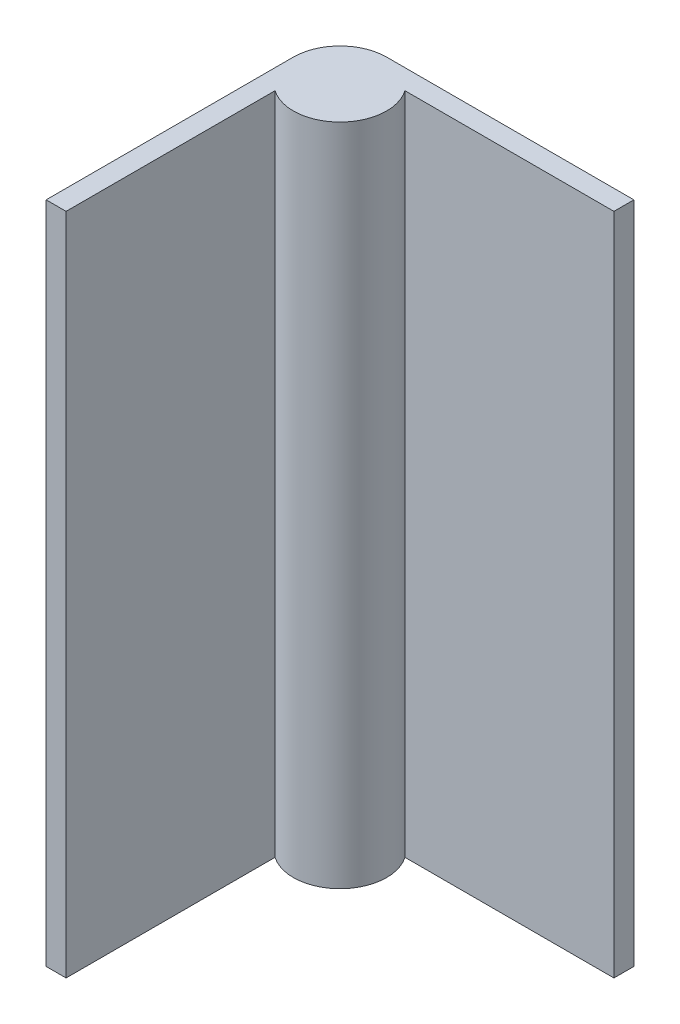
ISO-10303-21;
HEADER;
FILE_DESCRIPTION(('STEP AP214'),'2;1');
FILE_NAME('part.step','',(''),(''),'','','');
FILE_SCHEMA(('AUTOMOTIVE_DESIGN { 1 0 10303 214 1 1 1 1 }'));
ENDSEC;
DATA;
#1=APPLICATION_CONTEXT('core data for automotive mechanical design processes');
#2=APPLICATION_PROTOCOL_DEFINITION('international standard','automotive_design',2000,#1);
#3=PRODUCT_CONTEXT('',#1,'mechanical');
#4=PRODUCT('Part','Part','',(#3));
#5=PRODUCT_RELATED_PRODUCT_CATEGORY('part','',(#4));
#6=PRODUCT_DEFINITION_FORMATION('','',#4);
#7=PRODUCT_DEFINITION_CONTEXT('part definition',#1,'design');
#8=PRODUCT_DEFINITION('design','',#6,#7);
#9=PRODUCT_DEFINITION_SHAPE('','',#8);
#10=(LENGTH_UNIT() NAMED_UNIT(*) SI_UNIT(.MILLI.,.METRE.));
#11=(NAMED_UNIT(*) PLANE_ANGLE_UNIT() SI_UNIT($,.RADIAN.));
#12=(NAMED_UNIT(*) SI_UNIT($,.STERADIAN.) SOLID_ANGLE_UNIT());
#13=UNCERTAINTY_MEASURE_WITH_UNIT(LENGTH_MEASURE(1.E-05),#10,'distance_accuracy_value','');
#14=(GEOMETRIC_REPRESENTATION_CONTEXT(3) GLOBAL_UNCERTAINTY_ASSIGNED_CONTEXT((#13)) GLOBAL_UNIT_ASSIGNED_CONTEXT((#10,
#11,#12)) REPRESENTATION_CONTEXT('',''));
#15=CARTESIAN_POINT('',(0.,0.,0.));
#16=DIRECTION('',(0.,0.,1.));
#17=DIRECTION('',(1.,0.,0.));
#18=AXIS2_PLACEMENT_3D('',#15,#16,#17);
#19=CARTESIAN_POINT('',(-5.67,25.62,-5.67));
#20=DIRECTION('',(0.,-1.,0.));
#21=DIRECTION('',(0.,0.,-1.));
#22=AXIS2_PLACEMENT_3D('',#19,#20,#21);
#23=CYLINDRICAL_SURFACE('',#22,1.8);
#24=CARTESIAN_POINT('',(-5.67,0.,-5.67));
#25=DIRECTION('',(0.,1.,0.));
#26=DIRECTION('',(0.,0.,1.));
#27=AXIS2_PLACEMENT_3D('',#24,#25,#26);
#28=CIRCLE('',#27,1.8);
#29=CARTESIAN_POINT('',(-4.19382250389731,0.,-6.7));
#30=VERTEX_POINT('',#29);
#31=CARTESIAN_POINT('',(-6.7,0.,-4.19382250389731));
#32=VERTEX_POINT('',#31);
#33=EDGE_CURVE('E126',#30,#32,#28,.F.);
#34=ORIENTED_EDGE('',*,*,#33,.F.);
#35=DIRECTION('',(0.,-1.,0.));
#36=VECTOR('',#35,1.);
#37=CARTESIAN_POINT('',(-4.19382250389731,25.62,-6.7));
#38=LINE('',#37,#36);
#39=CARTESIAN_POINT('',(-4.19382250389731,25.62,-6.7));
#40=VERTEX_POINT('',#39);
#41=EDGE_CURVE('E11',#40,#30,#38,.T.);
#42=ORIENTED_EDGE('',*,*,#41,.F.);
#43=CARTESIAN_POINT('',(-5.67,25.62,-5.67));
#44=DIRECTION('',(0.,1.,0.));
#45=DIRECTION('',(0.,0.,1.));
#46=AXIS2_PLACEMENT_3D('',#43,#44,#45);
#47=CIRCLE('',#46,1.8);
#48=CARTESIAN_POINT('',(-6.7,25.62,-4.19382250389731));
#49=VERTEX_POINT('',#48);
#50=EDGE_CURVE('E146',#40,#49,#47,.F.);
#51=ORIENTED_EDGE('',*,*,#50,.T.);
#52=DIRECTION('',(0.,-1.,0.));
#53=VECTOR('',#52,1.);
#54=CARTESIAN_POINT('',(-6.7,25.62,-4.19382250389731));
#55=LINE('',#54,#53);
#56=EDGE_CURVE('E49',#49,#32,#55,.T.);
#57=ORIENTED_EDGE('',*,*,#56,.T.);
#58=EDGE_LOOP('',(#34,#42,#51,#57));
#59=FACE_BOUND('',#58,.T.);
#60=ADVANCED_FACE('F33',(#59),#23,.T.);
#61=CARTESIAN_POINT('',(0.,25.62,-6.7));
#62=DIRECTION('',(0.,0.,1.));
#63=DIRECTION('',(1.,0.,0.));
#64=AXIS2_PLACEMENT_3D('',#61,#62,#63);
#65=PLANE('',#64);
#66=DIRECTION('',(-1.,0.,0.));
#67=VECTOR('',#66,1.);
#68=CARTESIAN_POINT('',(0.,0.,-6.7));
#69=LINE('',#68,#67);
#70=CARTESIAN_POINT('',(3.87,0.,-6.7));
#71=VERTEX_POINT('',#70);
#72=EDGE_CURVE('E128',#71,#30,#69,.T.);
#73=ORIENTED_EDGE('',*,*,#72,.F.);
#74=DIRECTION('',(0.,-1.,0.));
#75=VECTOR('',#74,1.);
#76=CARTESIAN_POINT('',(3.87,25.62,-6.7));
#77=LINE('',#76,#75);
#78=CARTESIAN_POINT('',(3.87,25.62,-6.7));
#79=VERTEX_POINT('',#78);
#80=EDGE_CURVE('E41',#79,#71,#77,.T.);
#81=ORIENTED_EDGE('',*,*,#80,.F.);
#82=DIRECTION('',(-1.,0.,0.));
#83=VECTOR('',#82,1.);
#84=CARTESIAN_POINT('',(0.,25.62,-6.7));
#85=LINE('',#84,#83);
#86=EDGE_CURVE('E167',#79,#40,#85,.T.);
#87=ORIENTED_EDGE('',*,*,#86,.T.);
#88=ORIENTED_EDGE('',*,*,#41,.T.);
#89=EDGE_LOOP('',(#73,#81,#87,#88));
#90=FACE_BOUND('',#89,.T.);
#91=ADVANCED_FACE('F166',(#90),#65,.T.);
#92=CARTESIAN_POINT('',(3.86999999999999,25.62,0.));
#93=DIRECTION('',(-1.,0.,0.));
#94=DIRECTION('',(0.,0.,1.));
#95=AXIS2_PLACEMENT_3D('',#92,#93,#94);
#96=PLANE('',#95);
#97=DIRECTION('',(0.,0.,-1.));
#98=VECTOR('',#97,1.);
#99=CARTESIAN_POINT('',(3.86999999999999,0.,0.));
#100=LINE('',#99,#98);
#101=CARTESIAN_POINT('',(3.87,0.,-7.47));
#102=VERTEX_POINT('',#101);
#103=EDGE_CURVE('E131',#71,#102,#100,.T.);
#104=ORIENTED_EDGE('',*,*,#103,.T.);
#105=DIRECTION('',(0.,-1.,0.));
#106=VECTOR('',#105,1.);
#107=CARTESIAN_POINT('',(3.87,25.62,-7.47));
#108=LINE('',#107,#106);
#109=CARTESIAN_POINT('',(3.87,25.62,-7.47));
#110=VERTEX_POINT('',#109);
#111=EDGE_CURVE('E152',#110,#102,#108,.T.);
#112=ORIENTED_EDGE('',*,*,#111,.F.);
#113=DIRECTION('',(0.,0.,-1.));
#114=VECTOR('',#113,1.);
#115=CARTESIAN_POINT('',(3.86999999999999,25.62,0.));
#116=LINE('',#115,#114);
#117=EDGE_CURVE('E158',#79,#110,#116,.T.);
#118=ORIENTED_EDGE('',*,*,#117,.F.);
#119=ORIENTED_EDGE('',*,*,#80,.T.);
#120=EDGE_LOOP('',(#104,#112,#118,#119));
#121=FACE_BOUND('',#120,.T.);
#122=ADVANCED_FACE('F156',(#121),#96,.F.);
#123=CARTESIAN_POINT('',(0.,25.62,-7.47));
#124=DIRECTION('',(0.,0.,-1.));
#125=DIRECTION('',(-1.,0.,0.));
#126=AXIS2_PLACEMENT_3D('',#123,#124,#125);
#127=PLANE('',#126);
#128=DIRECTION('',(1.,0.,0.));
#129=VECTOR('',#128,1.);
#130=CARTESIAN_POINT('',(0.,0.,-7.47));
#131=LINE('',#130,#129);
#132=CARTESIAN_POINT('',(-5.67,0.,-7.47));
#133=VERTEX_POINT('',#132);
#134=EDGE_CURVE('E134',#133,#102,#131,.T.);
#135=ORIENTED_EDGE('',*,*,#134,.F.);
#136=DIRECTION('',(0.,-1.,0.));
#137=VECTOR('',#136,1.);
#138=CARTESIAN_POINT('',(-5.67,25.62,-7.47));
#139=LINE('',#138,#137);
#140=CARTESIAN_POINT('',(-5.67,25.62,-7.47));
#141=VERTEX_POINT('',#140);
#142=EDGE_CURVE('E150',#141,#133,#139,.T.);
#143=ORIENTED_EDGE('',*,*,#142,.F.);
#144=DIRECTION('',(1.,0.,0.));
#145=VECTOR('',#144,1.);
#146=CARTESIAN_POINT('',(0.,25.62,-7.47));
#147=LINE('',#146,#145);
#148=EDGE_CURVE('E265',#141,#110,#147,.T.);
#149=ORIENTED_EDGE('',*,*,#148,.T.);
#150=ORIENTED_EDGE('',*,*,#111,.T.);
#151=EDGE_LOOP('',(#135,#143,#149,#150));
#152=FACE_BOUND('',#151,.T.);
#153=ADVANCED_FACE('F185',(#152),#127,.T.);
#154=CARTESIAN_POINT('',(-5.67,25.62,-5.67));
#155=DIRECTION('',(0.,-1.,0.));
#156=DIRECTION('',(0.,0.,-1.));
#157=AXIS2_PLACEMENT_3D('',#154,#155,#156);
#158=CYLINDRICAL_SURFACE('',#157,1.8);
#159=CARTESIAN_POINT('',(-5.67,0.,-5.67));
#160=DIRECTION('',(0.,1.,0.));
#161=DIRECTION('',(0.,0.,1.));
#162=AXIS2_PLACEMENT_3D('',#159,#160,#161);
#163=CIRCLE('',#162,1.8);
#164=CARTESIAN_POINT('',(-7.47,0.,-5.67));
#165=VERTEX_POINT('',#164);
#166=EDGE_CURVE('E137',#165,#133,#163,.F.);
#167=ORIENTED_EDGE('',*,*,#166,.F.);
#168=DIRECTION('',(0.,-1.,0.));
#169=VECTOR('',#168,1.);
#170=CARTESIAN_POINT('',(-7.47,25.62,-5.67));
#171=LINE('',#170,#169);
#172=CARTESIAN_POINT('',(-7.47,25.62,-5.67));
#173=VERTEX_POINT('',#172);
#174=EDGE_CURVE('E108',#173,#165,#171,.T.);
#175=ORIENTED_EDGE('',*,*,#174,.F.);
#176=CARTESIAN_POINT('',(-5.67,25.62,-5.67));
#177=DIRECTION('',(0.,1.,0.));
#178=DIRECTION('',(0.,0.,1.));
#179=AXIS2_PLACEMENT_3D('',#176,#177,#178);
#180=CIRCLE('',#179,1.8);
#181=EDGE_CURVE('E118',#173,#141,#180,.F.);
#182=ORIENTED_EDGE('',*,*,#181,.T.);
#183=ORIENTED_EDGE('',*,*,#142,.T.);
#184=EDGE_LOOP('',(#167,#175,#182,#183));
#185=FACE_BOUND('',#184,.T.);
#186=ADVANCED_FACE('F190',(#185),#158,.T.);
#187=CARTESIAN_POINT('',(-7.47,25.62,0.));
#188=DIRECTION('',(-1.,0.,0.));
#189=DIRECTION('',(0.,0.,1.));
#190=AXIS2_PLACEMENT_3D('',#187,#188,#189);
#191=PLANE('',#190);
#192=DIRECTION('',(0.,0.,-1.));
#193=VECTOR('',#192,1.);
#194=CARTESIAN_POINT('',(-7.47,0.,0.));
#195=LINE('',#194,#193);
#196=CARTESIAN_POINT('',(-7.47,0.,3.87));
#197=VERTEX_POINT('',#196);
#198=EDGE_CURVE('E104',#197,#165,#195,.T.);
#199=ORIENTED_EDGE('',*,*,#198,.F.);
#200=DIRECTION('',(0.,-1.,0.));
#201=VECTOR('',#200,1.);
#202=CARTESIAN_POINT('',(-7.47,25.62,3.87));
#203=LINE('',#202,#201);
#204=CARTESIAN_POINT('',(-7.47,25.62,3.87));
#205=VERTEX_POINT('',#204);
#206=EDGE_CURVE('E99',#205,#197,#203,.T.);
#207=ORIENTED_EDGE('',*,*,#206,.F.);
#208=DIRECTION('',(0.,0.,-1.));
#209=VECTOR('',#208,1.);
#210=CARTESIAN_POINT('',(-7.47,25.62,0.));
#211=LINE('',#210,#209);
#212=EDGE_CURVE('E102',#205,#173,#211,.T.);
#213=ORIENTED_EDGE('',*,*,#212,.T.);
#214=ORIENTED_EDGE('',*,*,#174,.T.);
#215=EDGE_LOOP('',(#199,#207,#213,#214));
#216=FACE_BOUND('',#215,.T.);
#217=ADVANCED_FACE('F101',(#216),#191,.T.);
#218=CARTESIAN_POINT('',(0.,25.62,3.87));
#219=DIRECTION('',(0.,0.,1.));
#220=DIRECTION('',(1.,0.,0.));
#221=AXIS2_PLACEMENT_3D('',#218,#219,#220);
#222=PLANE('',#221);
#223=DIRECTION('',(-1.,0.,0.));
#224=VECTOR('',#223,1.);
#225=CARTESIAN_POINT('',(0.,0.,3.87));
#226=LINE('',#225,#224);
#227=CARTESIAN_POINT('',(-6.7,0.,3.87));
#228=VERTEX_POINT('',#227);
#229=EDGE_CURVE('E141',#228,#197,#226,.T.);
#230=ORIENTED_EDGE('',*,*,#229,.F.);
#231=DIRECTION('',(0.,-1.,0.));
#232=VECTOR('',#231,1.);
#233=CARTESIAN_POINT('',(-6.7,25.62,3.87));
#234=LINE('',#233,#232);
#235=CARTESIAN_POINT('',(-6.7,25.62,3.87));
#236=VERTEX_POINT('',#235);
#237=EDGE_CURVE('E74',#236,#228,#234,.T.);
#238=ORIENTED_EDGE('',*,*,#237,.F.);
#239=DIRECTION('',(-1.,0.,0.));
#240=VECTOR('',#239,1.);
#241=CARTESIAN_POINT('',(0.,25.62,3.87));
#242=LINE('',#241,#240);
#243=EDGE_CURVE('E115',#236,#205,#242,.T.);
#244=ORIENTED_EDGE('',*,*,#243,.T.);
#245=ORIENTED_EDGE('',*,*,#206,.T.);
#246=EDGE_LOOP('',(#230,#238,#244,#245));
#247=FACE_BOUND('',#246,.T.);
#248=ADVANCED_FACE('F120',(#247),#222,.T.);
#249=CARTESIAN_POINT('',(-6.7,25.62,0.));
#250=DIRECTION('',(1.,0.,0.));
#251=DIRECTION('',(0.,0.,-1.));
#252=AXIS2_PLACEMENT_3D('',#249,#250,#251);
#253=PLANE('',#252);
#254=DIRECTION('',(0.,0.,1.));
#255=VECTOR('',#254,1.);
#256=CARTESIAN_POINT('',(-6.7,0.,0.));
#257=LINE('',#256,#255);
#258=EDGE_CURVE('E143',#32,#228,#257,.T.);
#259=ORIENTED_EDGE('',*,*,#258,.F.);
#260=ORIENTED_EDGE('',*,*,#56,.F.);
#261=DIRECTION('',(0.,0.,1.));
#262=VECTOR('',#261,1.);
#263=CARTESIAN_POINT('',(-6.7,25.62,0.));
#264=LINE('',#263,#262);
#265=EDGE_CURVE('E121',#49,#236,#264,.T.);
#266=ORIENTED_EDGE('',*,*,#265,.T.);
#267=ORIENTED_EDGE('',*,*,#237,.T.);
#268=EDGE_LOOP('',(#259,#260,#266,#267));
#269=FACE_BOUND('',#268,.T.);
#270=ADVANCED_FACE('F168',(#269),#253,.T.);
#271=CARTESIAN_POINT('',(0.,25.62,0.));
#272=DIRECTION('',(0.,1.,0.));
#273=DIRECTION('',(0.,0.,1.));
#274=AXIS2_PLACEMENT_3D('',#271,#272,#273);
#275=PLANE('',#274);
#276=ORIENTED_EDGE('',*,*,#50,.F.);
#277=ORIENTED_EDGE('',*,*,#86,.F.);
#278=ORIENTED_EDGE('',*,*,#117,.T.);
#279=ORIENTED_EDGE('',*,*,#148,.F.);
#280=ORIENTED_EDGE('',*,*,#181,.F.);
#281=ORIENTED_EDGE('',*,*,#212,.F.);
#282=ORIENTED_EDGE('',*,*,#243,.F.);
#283=ORIENTED_EDGE('',*,*,#265,.F.);
#284=EDGE_LOOP('',(#276,#277,#278,#279,#280,#281,#282,#283));
#285=FACE_BOUND('',#284,.T.);
#286=ADVANCED_FACE('F113',(#285),#275,.T.);
#287=CARTESIAN_POINT('',(0.,0.,0.));
#288=DIRECTION('',(0.,1.,0.));
#289=DIRECTION('',(0.,0.,1.));
#290=AXIS2_PLACEMENT_3D('',#287,#288,#289);
#291=PLANE('',#290);
#292=ORIENTED_EDGE('',*,*,#33,.T.);
#293=ORIENTED_EDGE('',*,*,#258,.T.);
#294=ORIENTED_EDGE('',*,*,#229,.T.);
#295=ORIENTED_EDGE('',*,*,#198,.T.);
#296=ORIENTED_EDGE('',*,*,#166,.T.);
#297=ORIENTED_EDGE('',*,*,#134,.T.);
#298=ORIENTED_EDGE('',*,*,#103,.F.);
#299=ORIENTED_EDGE('',*,*,#72,.T.);
#300=EDGE_LOOP('',(#292,#293,#294,#295,#296,#297,#298,#299));
#301=FACE_BOUND('',#300,.T.);
#302=ADVANCED_FACE('F164',(#301),#291,.F.);
#303=CLOSED_SHELL('',(#60,#91,#122,#153,#186,#217,#248,#270,#286,#302));
#304=MANIFOLD_SOLID_BREP('B2',#303);
#305=ADVANCED_BREP_SHAPE_REPRESENTATION('',(#18,#304),#14);
#306=SHAPE_DEFINITION_REPRESENTATION(#9,#305);
ENDSEC;
END-ISO-10303-21;
